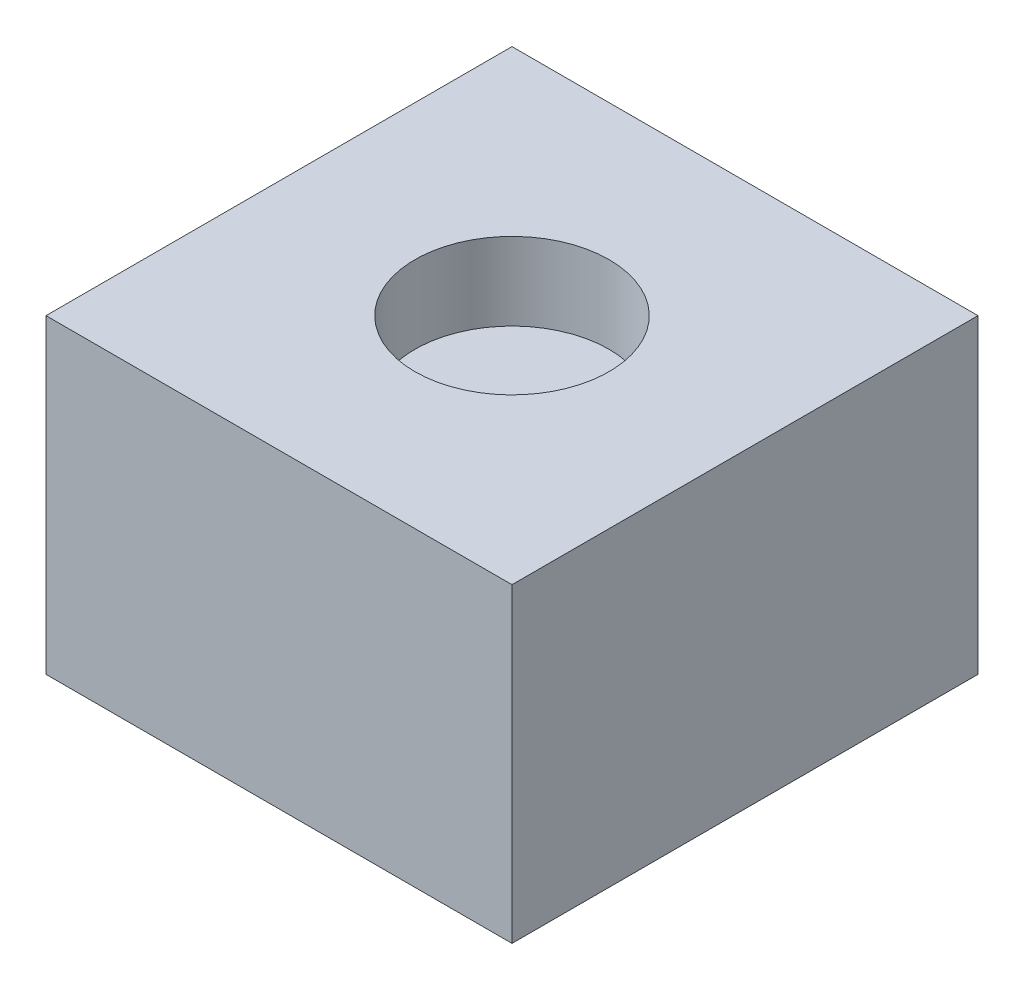
ISO-10303-21;
HEADER;
FILE_DESCRIPTION(('STEP AP214'),'2;1');
FILE_NAME('part.step','',(''),(''),'','','');
FILE_SCHEMA(('AUTOMOTIVE_DESIGN { 1 0 10303 214 1 1 1 1 }'));
ENDSEC;
DATA;
#1=APPLICATION_CONTEXT('core data for automotive mechanical design processes');
#2=APPLICATION_PROTOCOL_DEFINITION('international standard','automotive_design',2000,#1);
#3=PRODUCT_CONTEXT('',#1,'mechanical');
#4=PRODUCT('Part','Part','',(#3));
#5=PRODUCT_RELATED_PRODUCT_CATEGORY('part','',(#4));
#6=PRODUCT_DEFINITION_FORMATION('','',#4);
#7=PRODUCT_DEFINITION_CONTEXT('part definition',#1,'design');
#8=PRODUCT_DEFINITION('design','',#6,#7);
#9=PRODUCT_DEFINITION_SHAPE('','',#8);
#10=(LENGTH_UNIT() NAMED_UNIT(*) SI_UNIT(.MILLI.,.METRE.));
#11=(NAMED_UNIT(*) PLANE_ANGLE_UNIT() SI_UNIT($,.RADIAN.));
#12=(NAMED_UNIT(*) SI_UNIT($,.STERADIAN.) SOLID_ANGLE_UNIT());
#13=UNCERTAINTY_MEASURE_WITH_UNIT(LENGTH_MEASURE(1.E-05),#10,'distance_accuracy_value','');
#14=(GEOMETRIC_REPRESENTATION_CONTEXT(3) GLOBAL_UNCERTAINTY_ASSIGNED_CONTEXT((#13)) GLOBAL_UNIT_ASSIGNED_CONTEXT((#10,
#11,#12)) REPRESENTATION_CONTEXT('',''));
#15=CARTESIAN_POINT('',(0.,0.,0.));
#16=DIRECTION('',(0.,0.,1.));
#17=DIRECTION('',(1.,0.,0.));
#18=AXIS2_PLACEMENT_3D('',#15,#16,#17);
#19=CARTESIAN_POINT('',(6.,8.,6.));
#20=DIRECTION('',(-1.,0.,0.));
#21=DIRECTION('',(0.,0.,1.));
#22=AXIS2_PLACEMENT_3D('',#19,#20,#21);
#23=PLANE('',#22);
#24=DIRECTION('',(0.,0.,-1.));
#25=VECTOR('',#24,1.);
#26=CARTESIAN_POINT('',(6.,0.,6.));
#27=LINE('',#26,#25);
#28=CARTESIAN_POINT('',(6.,0.,6.));
#29=VERTEX_POINT('',#28);
#30=CARTESIAN_POINT('',(6.,0.,-6.));
#31=VERTEX_POINT('',#30);
#32=EDGE_CURVE('E100',#29,#31,#27,.T.);
#33=ORIENTED_EDGE('',*,*,#32,.T.);
#34=DIRECTION('',(0.,-1.,0.));
#35=VECTOR('',#34,1.);
#36=CARTESIAN_POINT('',(6.,8.,-6.));
#37=LINE('',#36,#35);
#38=CARTESIAN_POINT('',(6.,8.,-6.));
#39=VERTEX_POINT('',#38);
#40=EDGE_CURVE('E42',#39,#31,#37,.T.);
#41=ORIENTED_EDGE('',*,*,#40,.F.);
#42=DIRECTION('',(0.,0.,-1.));
#43=VECTOR('',#42,1.);
#44=CARTESIAN_POINT('',(6.,8.,6.));
#45=LINE('',#44,#43);
#46=CARTESIAN_POINT('',(6.,8.,6.));
#47=VERTEX_POINT('',#46);
#48=EDGE_CURVE('E86',#47,#39,#45,.T.);
#49=ORIENTED_EDGE('',*,*,#48,.F.);
#50=DIRECTION('',(0.,-1.,0.));
#51=VECTOR('',#50,1.);
#52=CARTESIAN_POINT('',(6.,8.,6.));
#53=LINE('',#52,#51);
#54=EDGE_CURVE('E96',#47,#29,#53,.T.);
#55=ORIENTED_EDGE('',*,*,#54,.T.);
#56=EDGE_LOOP('',(#33,#41,#49,#55));
#57=FACE_BOUND('',#56,.T.);
#58=ADVANCED_FACE('F33',(#57),#23,.F.);
#59=CARTESIAN_POINT('',(-6.,8.,-6.));
#60=DIRECTION('',(0.,0.,1.));
#61=DIRECTION('',(1.,0.,0.));
#62=AXIS2_PLACEMENT_3D('',#59,#60,#61);
#63=PLANE('',#62);
#64=DIRECTION('',(-1.,0.,0.));
#65=VECTOR('',#64,1.);
#66=CARTESIAN_POINT('',(-6.,0.,-6.));
#67=LINE('',#66,#65);
#68=CARTESIAN_POINT('',(-6.,0.,-6.));
#69=VERTEX_POINT('',#68);
#70=EDGE_CURVE('E91',#31,#69,#67,.T.);
#71=ORIENTED_EDGE('',*,*,#70,.T.);
#72=DIRECTION('',(0.,-1.,0.));
#73=VECTOR('',#72,1.);
#74=CARTESIAN_POINT('',(-6.,8.,-6.));
#75=LINE('',#74,#73);
#76=CARTESIAN_POINT('',(-6.,8.,-6.));
#77=VERTEX_POINT('',#76);
#78=EDGE_CURVE('E89',#77,#69,#75,.T.);
#79=ORIENTED_EDGE('',*,*,#78,.F.);
#80=DIRECTION('',(-1.,0.,0.));
#81=VECTOR('',#80,1.);
#82=CARTESIAN_POINT('',(-6.,8.,-6.));
#83=LINE('',#82,#81);
#84=EDGE_CURVE('E81',#39,#77,#83,.T.);
#85=ORIENTED_EDGE('',*,*,#84,.F.);
#86=ORIENTED_EDGE('',*,*,#40,.T.);
#87=EDGE_LOOP('',(#71,#79,#85,#86));
#88=FACE_BOUND('',#87,.T.);
#89=ADVANCED_FACE('F90',(#88),#63,.F.);
#90=CARTESIAN_POINT('',(-6.,8.,6.));
#91=DIRECTION('',(1.,0.,0.));
#92=DIRECTION('',(0.,0.,-1.));
#93=AXIS2_PLACEMENT_3D('',#90,#91,#92);
#94=PLANE('',#93);
#95=DIRECTION('',(0.,0.,1.));
#96=VECTOR('',#95,1.);
#97=CARTESIAN_POINT('',(-6.,0.,6.));
#98=LINE('',#97,#96);
#99=CARTESIAN_POINT('',(-6.,0.,6.));
#100=VERTEX_POINT('',#99);
#101=EDGE_CURVE('E67',#69,#100,#98,.T.);
#102=ORIENTED_EDGE('',*,*,#101,.T.);
#103=DIRECTION('',(0.,-1.,0.));
#104=VECTOR('',#103,1.);
#105=CARTESIAN_POINT('',(-6.,8.,6.));
#106=LINE('',#105,#104);
#107=CARTESIAN_POINT('',(-6.,8.,6.));
#108=VERTEX_POINT('',#107);
#109=EDGE_CURVE('E92',#108,#100,#106,.T.);
#110=ORIENTED_EDGE('',*,*,#109,.F.);
#111=DIRECTION('',(0.,0.,1.));
#112=VECTOR('',#111,1.);
#113=CARTESIAN_POINT('',(-6.,8.,6.));
#114=LINE('',#113,#112);
#115=EDGE_CURVE('E84',#77,#108,#114,.T.);
#116=ORIENTED_EDGE('',*,*,#115,.F.);
#117=ORIENTED_EDGE('',*,*,#78,.T.);
#118=EDGE_LOOP('',(#102,#110,#116,#117));
#119=FACE_BOUND('',#118,.T.);
#120=ADVANCED_FACE('F94',(#119),#94,.F.);
#121=CARTESIAN_POINT('',(-6.,8.,6.));
#122=DIRECTION('',(0.,0.,-1.));
#123=DIRECTION('',(-1.,0.,0.));
#124=AXIS2_PLACEMENT_3D('',#121,#122,#123);
#125=PLANE('',#124);
#126=DIRECTION('',(1.,0.,0.));
#127=VECTOR('',#126,1.);
#128=CARTESIAN_POINT('',(-6.,0.,6.));
#129=LINE('',#128,#127);
#130=EDGE_CURVE('E73',#100,#29,#129,.T.);
#131=ORIENTED_EDGE('',*,*,#130,.T.);
#132=ORIENTED_EDGE('',*,*,#54,.F.);
#133=DIRECTION('',(1.,0.,0.));
#134=VECTOR('',#133,1.);
#135=CARTESIAN_POINT('',(-6.,8.,6.));
#136=LINE('',#135,#134);
#137=EDGE_CURVE('E50',#108,#47,#136,.T.);
#138=ORIENTED_EDGE('',*,*,#137,.F.);
#139=ORIENTED_EDGE('',*,*,#109,.T.);
#140=EDGE_LOOP('',(#131,#132,#138,#139));
#141=FACE_BOUND('',#140,.T.);
#142=ADVANCED_FACE('F123',(#141),#125,.F.);
#143=CARTESIAN_POINT('',(0.,8.,0.));
#144=DIRECTION('',(0.,-1.,0.));
#145=DIRECTION('',(0.,0.,-1.));
#146=AXIS2_PLACEMENT_3D('',#143,#144,#145);
#147=PLANE('',#146);
#148=CARTESIAN_POINT('',(0.,8.,0.));
#149=DIRECTION('',(0.,1.,0.));
#150=DIRECTION('',(0.,0.,1.));
#151=AXIS2_PLACEMENT_3D('',#148,#149,#150);
#152=CIRCLE('',#151,2.5);
#153=CARTESIAN_POINT('',(0.,8.,2.5));
#154=VERTEX_POINT('',#153);
#155=EDGE_CURVE('E189',#154,#154,#152,.T.);
#156=ORIENTED_EDGE('',*,*,#155,.F.);
#157=EDGE_LOOP('',(#156));
#158=FACE_BOUND('',#157,.T.);
#159=ORIENTED_EDGE('',*,*,#48,.T.);
#160=ORIENTED_EDGE('',*,*,#84,.T.);
#161=ORIENTED_EDGE('',*,*,#115,.T.);
#162=ORIENTED_EDGE('',*,*,#137,.T.);
#163=EDGE_LOOP('',(#159,#160,#161,#162));
#164=FACE_BOUND('',#163,.T.);
#165=ADVANCED_FACE('F82',(#158,#164),#147,.F.);
#166=CARTESIAN_POINT('',(0.,0.,0.));
#167=DIRECTION('',(0.,-1.,0.));
#168=DIRECTION('',(0.,0.,-1.));
#169=AXIS2_PLACEMENT_3D('',#166,#167,#168);
#170=PLANE('',#169);
#171=CARTESIAN_POINT('',(0.,0.,0.));
#172=DIRECTION('',(0.,-1.,0.));
#173=DIRECTION('',(0.,0.,-1.));
#174=AXIS2_PLACEMENT_3D('',#171,#172,#173);
#175=CIRCLE('',#174,1.);
#176=CARTESIAN_POINT('',(0.,0.,-1.));
#177=VERTEX_POINT('',#176);
#178=EDGE_CURVE('E188',#177,#177,#175,.T.);
#179=ORIENTED_EDGE('',*,*,#178,.F.);
#180=EDGE_LOOP('',(#179));
#181=FACE_BOUND('',#180,.T.);
#182=ORIENTED_EDGE('',*,*,#32,.F.);
#183=ORIENTED_EDGE('',*,*,#130,.F.);
#184=ORIENTED_EDGE('',*,*,#101,.F.);
#185=ORIENTED_EDGE('',*,*,#70,.F.);
#186=EDGE_LOOP('',(#182,#183,#184,#185));
#187=FACE_BOUND('',#186,.T.);
#188=ADVANCED_FACE('F111',(#181,#187),#170,.T.);
#189=CARTESIAN_POINT('',(0.,6.,0.));
#190=DIRECTION('',(0.,1.,0.));
#191=DIRECTION('',(0.,0.,1.));
#192=AXIS2_PLACEMENT_3D('',#189,#190,#191);
#193=CYLINDRICAL_SURFACE('',#192,2.5);
#194=CARTESIAN_POINT('',(0.,6.,0.));
#195=DIRECTION('',(0.,1.,0.));
#196=DIRECTION('',(0.,0.,1.));
#197=AXIS2_PLACEMENT_3D('',#194,#195,#196);
#198=CIRCLE('',#197,2.5);
#199=CARTESIAN_POINT('',(0.,6.,2.5));
#200=VERTEX_POINT('',#199);
#201=EDGE_CURVE('E103',#200,#200,#198,.T.);
#202=ORIENTED_EDGE('',*,*,#201,.F.);
#203=EDGE_LOOP('',(#202));
#204=FACE_BOUND('',#203,.T.);
#205=ORIENTED_EDGE('',*,*,#155,.T.);
#206=EDGE_LOOP('',(#205));
#207=FACE_BOUND('',#206,.T.);
#208=ADVANCED_FACE('F113',(#204,#207),#193,.F.);
#209=CARTESIAN_POINT('',(0.,6.,0.));
#210=DIRECTION('',(0.,1.,0.));
#211=DIRECTION('',(0.,0.,1.));
#212=AXIS2_PLACEMENT_3D('',#209,#210,#211);
#213=PLANE('',#212);
#214=ORIENTED_EDGE('',*,*,#201,.T.);
#215=EDGE_LOOP('',(#214));
#216=FACE_BOUND('',#215,.T.);
#217=ADVANCED_FACE('F120',(#216),#213,.T.);
#218=CARTESIAN_POINT('',(0.,2.,0.));
#219=DIRECTION('',(0.,-1.,0.));
#220=DIRECTION('',(0.,0.,-1.));
#221=AXIS2_PLACEMENT_3D('',#218,#219,#220);
#222=CYLINDRICAL_SURFACE('',#221,1.);
#223=CARTESIAN_POINT('',(0.,1.,0.));
#224=DIRECTION('',(0.,-1.,0.));
#225=DIRECTION('',(0.,0.,-1.));
#226=AXIS2_PLACEMENT_3D('',#223,#224,#225);
#227=CIRCLE('',#226,1.);
#228=CARTESIAN_POINT('',(0.,1.,-1.));
#229=VERTEX_POINT('',#228);
#230=EDGE_CURVE('E11',#229,#229,#227,.F.);
#231=ORIENTED_EDGE('',*,*,#230,.T.);
#232=EDGE_LOOP('',(#231));
#233=FACE_BOUND('',#232,.T.);
#234=ORIENTED_EDGE('',*,*,#178,.T.);
#235=EDGE_LOOP('',(#234));
#236=FACE_BOUND('',#235,.T.);
#237=ADVANCED_FACE('F159',(#233,#236),#222,.F.);
#238=CARTESIAN_POINT('',(0.,1.,0.));
#239=DIRECTION('',(0.,-1.,0.));
#240=DIRECTION('',(0.,0.,-1.));
#241=AXIS2_PLACEMENT_3D('',#238,#239,#240);
#242=SPHERICAL_SURFACE('',#241,1.);
#243=ORIENTED_EDGE('',*,*,#230,.F.);
#244=EDGE_LOOP('',(#243));
#245=FACE_BOUND('',#244,.T.);
#246=ADVANCED_FACE('F35',(#245),#242,.F.);
#247=CLOSED_SHELL('',(#58,#89,#120,#142,#165,#188,#208,#217,#237,#246));
#248=MANIFOLD_SOLID_BREP('B2',#247);
#249=ADVANCED_BREP_SHAPE_REPRESENTATION('',(#18,#248),#14);
#250=SHAPE_DEFINITION_REPRESENTATION(#9,#249);
ENDSEC;
END-ISO-10303-21;
